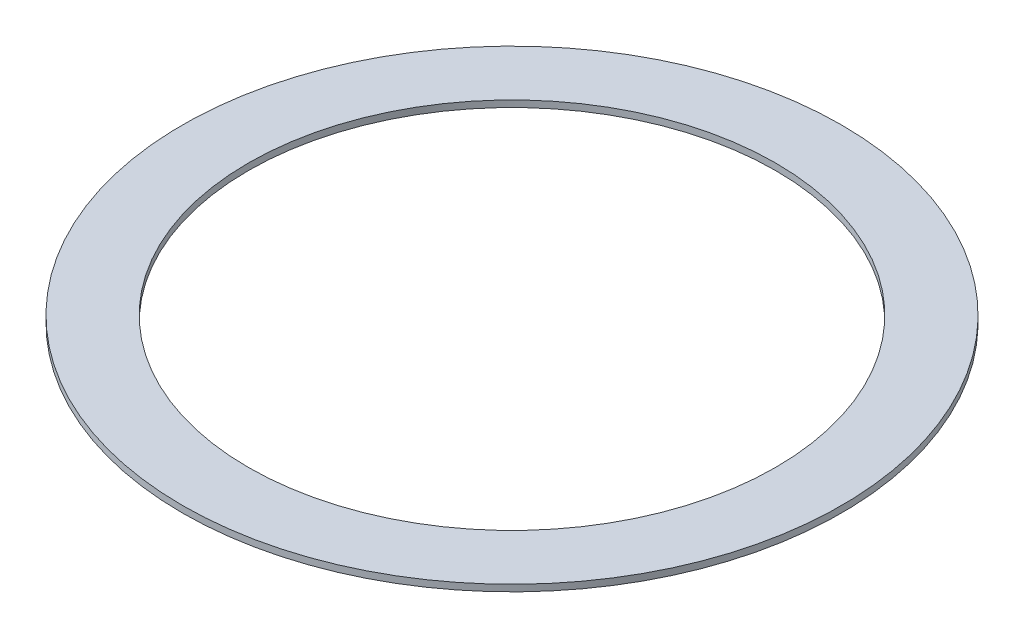
ISO-10303-21;
HEADER;
FILE_DESCRIPTION(('STEP AP214'),'2;1');
FILE_NAME('part.step','',(''),(''),'','','');
FILE_SCHEMA(('AUTOMOTIVE_DESIGN { 1 0 10303 214 1 1 1 1 }'));
ENDSEC;
DATA;
#1=APPLICATION_CONTEXT('core data for automotive mechanical design processes');
#2=APPLICATION_PROTOCOL_DEFINITION('international standard','automotive_design',2000,#1);
#3=PRODUCT_CONTEXT('',#1,'mechanical');
#4=PRODUCT('Part','Part','',(#3));
#5=PRODUCT_RELATED_PRODUCT_CATEGORY('part','',(#4));
#6=PRODUCT_DEFINITION_FORMATION('','',#4);
#7=PRODUCT_DEFINITION_CONTEXT('part definition',#1,'design');
#8=PRODUCT_DEFINITION('design','',#6,#7);
#9=PRODUCT_DEFINITION_SHAPE('','',#8);
#10=(LENGTH_UNIT() NAMED_UNIT(*) SI_UNIT(.MILLI.,.METRE.));
#11=(NAMED_UNIT(*) PLANE_ANGLE_UNIT() SI_UNIT($,.RADIAN.));
#12=(NAMED_UNIT(*) SI_UNIT($,.STERADIAN.) SOLID_ANGLE_UNIT());
#13=UNCERTAINTY_MEASURE_WITH_UNIT(LENGTH_MEASURE(1.E-05),#10,'distance_accuracy_value','');
#14=(GEOMETRIC_REPRESENTATION_CONTEXT(3) GLOBAL_UNCERTAINTY_ASSIGNED_CONTEXT((#13)) GLOBAL_UNIT_ASSIGNED_CONTEXT((#10,
#11,#12)) REPRESENTATION_CONTEXT('',''));
#15=CARTESIAN_POINT('',(0.,0.,0.));
#16=DIRECTION('',(0.,0.,1.));
#17=DIRECTION('',(1.,0.,0.));
#18=AXIS2_PLACEMENT_3D('',#15,#16,#17);
#19=CARTESIAN_POINT('',(0.,2.,0.));
#20=DIRECTION('',(0.,1.,0.));
#21=DIRECTION('',(0.,0.,1.));
#22=AXIS2_PLACEMENT_3D('',#19,#20,#21);
#23=PLANE('',#22);
#24=CARTESIAN_POINT('',(0.,2.,0.));
#25=DIRECTION('',(0.,1.,0.));
#26=DIRECTION('',(0.,0.,1.));
#27=AXIS2_PLACEMENT_3D('',#24,#25,#26);
#28=CIRCLE('',#27,100.);
#29=CARTESIAN_POINT('',(0.,2.,100.));
#30=VERTEX_POINT('',#29);
#31=EDGE_CURVE('E10',#30,#30,#28,.T.);
#32=ORIENTED_EDGE('',*,*,#31,.T.);
#33=EDGE_LOOP('',(#32));
#34=FACE_BOUND('',#33,.T.);
#35=CARTESIAN_POINT('',(0.,2.,0.));
#36=DIRECTION('',(0.,1.,0.));
#37=DIRECTION('',(0.,0.,1.));
#38=AXIS2_PLACEMENT_3D('',#35,#36,#37);
#39=CIRCLE('',#38,80.);
#40=CARTESIAN_POINT('',(0.,2.,80.));
#41=VERTEX_POINT('',#40);
#42=EDGE_CURVE('E40',#41,#41,#39,.T.);
#43=ORIENTED_EDGE('',*,*,#42,.F.);
#44=EDGE_LOOP('',(#43));
#45=FACE_BOUND('',#44,.T.);
#46=ADVANCED_FACE('F29',(#34,#45),#23,.T.);
#47=CARTESIAN_POINT('',(0.,0.,0.));
#48=DIRECTION('',(0.,1.,0.));
#49=DIRECTION('',(0.,0.,1.));
#50=AXIS2_PLACEMENT_3D('',#47,#48,#49);
#51=PLANE('',#50);
#52=CARTESIAN_POINT('',(0.,0.,0.));
#53=DIRECTION('',(0.,1.,0.));
#54=DIRECTION('',(0.,0.,1.));
#55=AXIS2_PLACEMENT_3D('',#52,#53,#54);
#56=CIRCLE('',#55,100.);
#57=CARTESIAN_POINT('',(0.,0.,100.));
#58=VERTEX_POINT('',#57);
#59=EDGE_CURVE('E33',#58,#58,#56,.T.);
#60=ORIENTED_EDGE('',*,*,#59,.F.);
#61=EDGE_LOOP('',(#60));
#62=FACE_BOUND('',#61,.T.);
#63=CARTESIAN_POINT('',(0.,0.,0.));
#64=DIRECTION('',(0.,1.,0.));
#65=DIRECTION('',(0.,0.,1.));
#66=AXIS2_PLACEMENT_3D('',#63,#64,#65);
#67=CIRCLE('',#66,80.);
#68=CARTESIAN_POINT('',(0.,0.,80.));
#69=VERTEX_POINT('',#68);
#70=EDGE_CURVE('E42',#69,#69,#67,.T.);
#71=ORIENTED_EDGE('',*,*,#70,.T.);
#72=EDGE_LOOP('',(#71));
#73=FACE_BOUND('',#72,.T.);
#74=ADVANCED_FACE('F52',(#62,#73),#51,.F.);
#75=CARTESIAN_POINT('',(0.,2.,0.));
#76=DIRECTION('',(0.,-1.,0.));
#77=DIRECTION('',(0.,0.,-1.));
#78=AXIS2_PLACEMENT_3D('',#75,#76,#77);
#79=CYLINDRICAL_SURFACE('',#78,100.);
#80=ORIENTED_EDGE('',*,*,#31,.F.);
#81=EDGE_LOOP('',(#80));
#82=FACE_BOUND('',#81,.T.);
#83=ORIENTED_EDGE('',*,*,#59,.T.);
#84=EDGE_LOOP('',(#83));
#85=FACE_BOUND('',#84,.T.);
#86=ADVANCED_FACE('F31',(#82,#85),#79,.T.);
#87=CARTESIAN_POINT('',(0.,2.,0.));
#88=DIRECTION('',(0.,-1.,0.));
#89=DIRECTION('',(0.,0.,-1.));
#90=AXIS2_PLACEMENT_3D('',#87,#88,#89);
#91=CYLINDRICAL_SURFACE('',#90,80.);
#92=ORIENTED_EDGE('',*,*,#42,.T.);
#93=EDGE_LOOP('',(#92));
#94=FACE_BOUND('',#93,.T.);
#95=ORIENTED_EDGE('',*,*,#70,.F.);
#96=EDGE_LOOP('',(#95));
#97=FACE_BOUND('',#96,.T.);
#98=ADVANCED_FACE('F48',(#94,#97),#91,.F.);
#99=CLOSED_SHELL('',(#46,#74,#86,#98));
#100=MANIFOLD_SOLID_BREP('B2',#99);
#101=ADVANCED_BREP_SHAPE_REPRESENTATION('',(#18,#100),#14);
#102=SHAPE_DEFINITION_REPRESENTATION(#9,#101);
ENDSEC;
END-ISO-10303-21;
